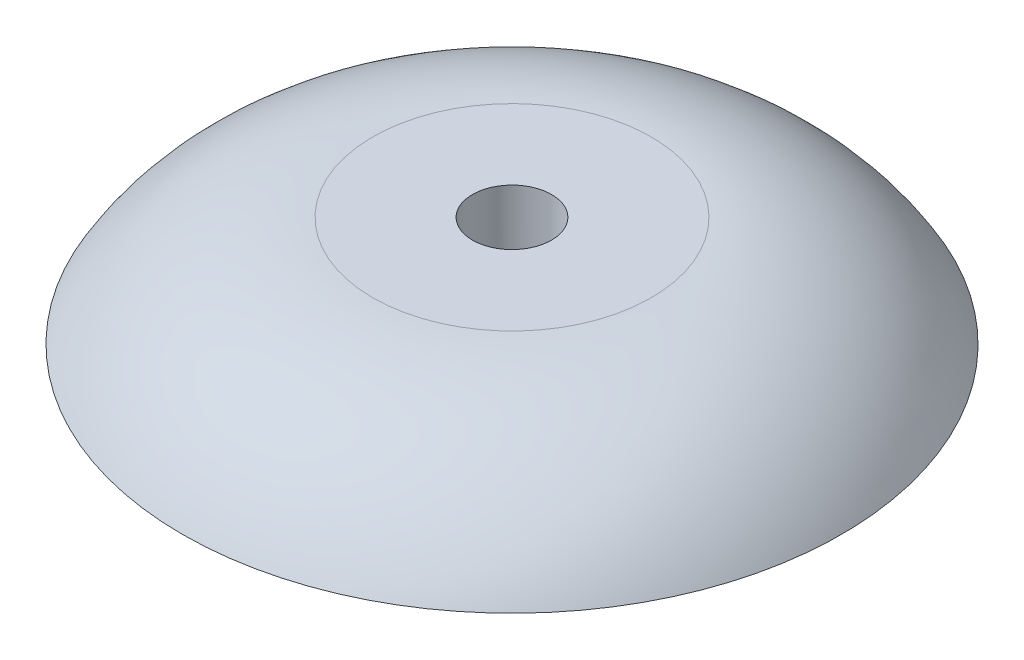
ISO-10303-21;
HEADER;
FILE_DESCRIPTION(('STEP AP214'),'2;1');
FILE_NAME('part.step','',(''),(''),'','','');
FILE_SCHEMA(('AUTOMOTIVE_DESIGN { 1 0 10303 214 1 1 1 1 }'));
ENDSEC;
DATA;
#1=APPLICATION_CONTEXT('core data for automotive mechanical design processes');
#2=APPLICATION_PROTOCOL_DEFINITION('international standard','automotive_design',2000,#1);
#3=PRODUCT_CONTEXT('',#1,'mechanical');
#4=PRODUCT('Part','Part','',(#3));
#5=PRODUCT_RELATED_PRODUCT_CATEGORY('part','',(#4));
#6=PRODUCT_DEFINITION_FORMATION('','',#4);
#7=PRODUCT_DEFINITION_CONTEXT('part definition',#1,'design');
#8=PRODUCT_DEFINITION('design','',#6,#7);
#9=PRODUCT_DEFINITION_SHAPE('','',#8);
#10=(LENGTH_UNIT() NAMED_UNIT(*) SI_UNIT(.MILLI.,.METRE.));
#11=(NAMED_UNIT(*) PLANE_ANGLE_UNIT() SI_UNIT($,.RADIAN.));
#12=(NAMED_UNIT(*) SI_UNIT($,.STERADIAN.) SOLID_ANGLE_UNIT());
#13=UNCERTAINTY_MEASURE_WITH_UNIT(LENGTH_MEASURE(1.E-05),#10,'distance_accuracy_value','');
#14=(GEOMETRIC_REPRESENTATION_CONTEXT(3) GLOBAL_UNCERTAINTY_ASSIGNED_CONTEXT((#13)) GLOBAL_UNIT_ASSIGNED_CONTEXT((#10,
#11,#12)) REPRESENTATION_CONTEXT('',''));
#15=CARTESIAN_POINT('',(0.,0.,0.));
#16=DIRECTION('',(0.,0.,1.));
#17=DIRECTION('',(1.,0.,0.));
#18=AXIS2_PLACEMENT_3D('',#15,#16,#17);
#19=CARTESIAN_POINT('',(0.,5.,0.));
#20=DIRECTION('',(0.,1.,0.));
#21=DIRECTION('',(0.,0.,1.));
#22=AXIS2_PLACEMENT_3D('',#19,#20,#21);
#23=PLANE('',#22);
#24=CARTESIAN_POINT('',(0.,5.,0.));
#25=DIRECTION('',(0.,1.,0.));
#26=DIRECTION('',(0.,0.,1.));
#27=AXIS2_PLACEMENT_3D('',#24,#25,#26);
#28=CIRCLE('',#27,6.33974596215561);
#29=CARTESIAN_POINT('',(0.,5.,6.33974596215561));
#30=VERTEX_POINT('',#29);
#31=EDGE_CURVE('E10',#30,#30,#28,.T.);
#32=ORIENTED_EDGE('',*,*,#31,.T.);
#33=EDGE_LOOP('',(#32));
#34=FACE_BOUND('',#33,.T.);
#35=CARTESIAN_POINT('',(0.,5.,0.));
#36=DIRECTION('',(0.,1.,0.));
#37=DIRECTION('',(0.,0.,1.));
#38=AXIS2_PLACEMENT_3D('',#35,#36,#37);
#39=CIRCLE('',#38,1.79999999999999);
#40=CARTESIAN_POINT('',(0.,5.,1.79999999999999));
#41=VERTEX_POINT('',#40);
#42=EDGE_CURVE('E68',#41,#41,#39,.T.);
#43=ORIENTED_EDGE('',*,*,#42,.F.);
#44=EDGE_LOOP('',(#43));
#45=FACE_BOUND('',#44,.T.);
#46=ADVANCED_FACE('F43',(#34,#45),#23,.T.);
#47=CARTESIAN_POINT('',(0.,0.,0.));
#48=DIRECTION('',(0.,1.,0.));
#49=DIRECTION('',(0.,0.,1.));
#50=AXIS2_PLACEMENT_3D('',#47,#48,#49);
#51=PLANE('',#50);
#52=CARTESIAN_POINT('',(0.,0.,0.));
#53=DIRECTION('',(0.,-1.,0.));
#54=DIRECTION('',(0.,0.,-1.));
#55=AXIS2_PLACEMENT_3D('',#52,#53,#54);
#56=CIRCLE('',#55,10.);
#57=CARTESIAN_POINT('',(0.,0.,-10.));
#58=VERTEX_POINT('',#57);
#59=EDGE_CURVE('E62',#58,#58,#56,.T.);
#60=ORIENTED_EDGE('',*,*,#59,.F.);
#61=EDGE_LOOP('',(#60));
#62=FACE_BOUND('',#61,.T.);
#63=CARTESIAN_POINT('',(0.,0.,0.));
#64=DIRECTION('',(0.,1.,0.));
#65=DIRECTION('',(0.,0.,1.));
#66=AXIS2_PLACEMENT_3D('',#63,#64,#65);
#67=CIRCLE('',#66,15.);
#68=CARTESIAN_POINT('',(0.,0.,15.));
#69=VERTEX_POINT('',#68);
#70=EDGE_CURVE('E51',#69,#69,#67,.T.);
#71=ORIENTED_EDGE('',*,*,#70,.F.);
#72=EDGE_LOOP('',(#71));
#73=FACE_BOUND('',#72,.T.);
#74=ADVANCED_FACE('F81',(#62,#73),#51,.F.);
#75=CARTESIAN_POINT('',(0.,2.,0.));
#76=DIRECTION('',(0.,-1.,0.));
#77=DIRECTION('',(0.,0.,-1.));
#78=AXIS2_PLACEMENT_3D('',#75,#76,#77);
#79=CYLINDRICAL_SURFACE('',#78,10.);
#80=CARTESIAN_POINT('',(0.,2.,0.));
#81=DIRECTION('',(0.,-1.,0.));
#82=DIRECTION('',(0.,0.,-1.));
#83=AXIS2_PLACEMENT_3D('',#80,#81,#82);
#84=CIRCLE('',#83,10.);
#85=CARTESIAN_POINT('',(0.,2.,-10.));
#86=VERTEX_POINT('',#85);
#87=EDGE_CURVE('E56',#86,#86,#84,.T.);
#88=ORIENTED_EDGE('',*,*,#87,.F.);
#89=EDGE_LOOP('',(#88));
#90=FACE_BOUND('',#89,.T.);
#91=ORIENTED_EDGE('',*,*,#59,.T.);
#92=EDGE_LOOP('',(#91));
#93=FACE_BOUND('',#92,.T.);
#94=ADVANCED_FACE('F88',(#90,#93),#79,.F.);
#95=CARTESIAN_POINT('',(0.,2.,0.));
#96=DIRECTION('',(0.,-1.,0.));
#97=DIRECTION('',(0.,0.,-1.));
#98=AXIS2_PLACEMENT_3D('',#95,#96,#97);
#99=PLANE('',#98);
#100=CARTESIAN_POINT('',(0.,2.,0.));
#101=DIRECTION('',(0.,-1.,0.));
#102=DIRECTION('',(0.,0.,-1.));
#103=AXIS2_PLACEMENT_3D('',#100,#101,#102);
#104=CIRCLE('',#103,1.79999999999999);
#105=CARTESIAN_POINT('',(0.,2.,-1.79999999999999));
#106=VERTEX_POINT('',#105);
#107=EDGE_CURVE('E65',#106,#106,#104,.T.);
#108=ORIENTED_EDGE('',*,*,#107,.F.);
#109=EDGE_LOOP('',(#108));
#110=FACE_BOUND('',#109,.T.);
#111=ORIENTED_EDGE('',*,*,#87,.T.);
#112=EDGE_LOOP('',(#111));
#113=FACE_BOUND('',#112,.T.);
#114=ADVANCED_FACE('F93',(#110,#113),#99,.T.);
#115=CARTESIAN_POINT('',(0.,5.,0.));
#116=DIRECTION('',(0.,1.,0.));
#117=DIRECTION('',(0.,0.,1.));
#118=AXIS2_PLACEMENT_3D('',#115,#116,#117);
#119=CYLINDRICAL_SURFACE('',#118,1.79999999999999);
#120=ORIENTED_EDGE('',*,*,#107,.T.);
#121=EDGE_LOOP('',(#120));
#122=FACE_BOUND('',#121,.T.);
#123=ORIENTED_EDGE('',*,*,#42,.T.);
#124=EDGE_LOOP('',(#123));
#125=FACE_BOUND('',#124,.T.);
#126=ADVANCED_FACE('F78',(#122,#125),#119,.F.);
#127=CARTESIAN_POINT('',(0.,-5.,0.));
#128=DIRECTION('',(0.,-1.,0.));
#129=DIRECTION('',(0.,0.,-1.));
#130=AXIS2_PLACEMENT_3D('',#127,#128,#129);
#131=DEGENERATE_TOROIDAL_SURFACE('',#130,6.33974596215561,10.,.T.);
#132=ORIENTED_EDGE('',*,*,#70,.T.);
#133=EDGE_LOOP('',(#132));
#134=FACE_BOUND('',#133,.T.);
#135=ORIENTED_EDGE('',*,*,#31,.F.);
#136=EDGE_LOOP('',(#135));
#137=FACE_BOUND('',#136,.T.);
#138=ADVANCED_FACE('F45',(#134,#137),#131,.T.);
#139=CLOSED_SHELL('',(#46,#74,#94,#114,#126,#138));
#140=MANIFOLD_SOLID_BREP('B2',#139);
#141=ADVANCED_BREP_SHAPE_REPRESENTATION('',(#18,#140),#14);
#142=SHAPE_DEFINITION_REPRESENTATION(#9,#141);
ENDSEC;
END-ISO-10303-21;
